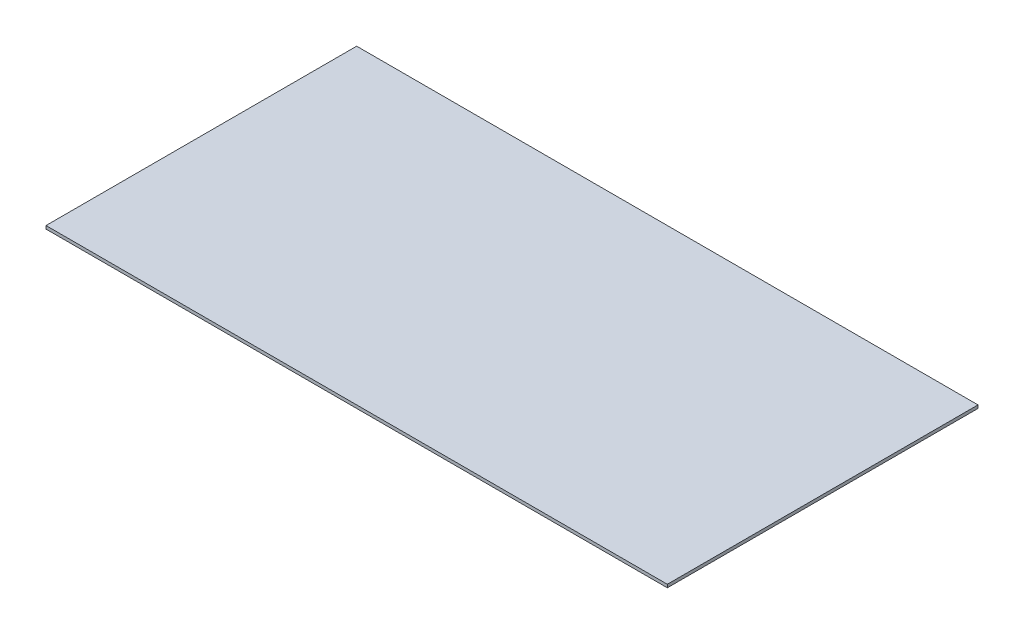
ISO-10303-21;
HEADER;
FILE_DESCRIPTION(('STEP AP214'),'2;1');
FILE_NAME('part.step','',(''),(''),'','','');
FILE_SCHEMA(('AUTOMOTIVE_DESIGN { 1 0 10303 214 1 1 1 1 }'));
ENDSEC;
DATA;
#1=APPLICATION_CONTEXT('core data for automotive mechanical design processes');
#2=APPLICATION_PROTOCOL_DEFINITION('international standard','automotive_design',2000,#1);
#3=PRODUCT_CONTEXT('',#1,'mechanical');
#4=PRODUCT('Part','Part','',(#3));
#5=PRODUCT_RELATED_PRODUCT_CATEGORY('part','',(#4));
#6=PRODUCT_DEFINITION_FORMATION('','',#4);
#7=PRODUCT_DEFINITION_CONTEXT('part definition',#1,'design');
#8=PRODUCT_DEFINITION('design','',#6,#7);
#9=PRODUCT_DEFINITION_SHAPE('','',#8);
#10=(LENGTH_UNIT() NAMED_UNIT(*) SI_UNIT(.MILLI.,.METRE.));
#11=(NAMED_UNIT(*) PLANE_ANGLE_UNIT() SI_UNIT($,.RADIAN.));
#12=(NAMED_UNIT(*) SI_UNIT($,.STERADIAN.) SOLID_ANGLE_UNIT());
#13=UNCERTAINTY_MEASURE_WITH_UNIT(LENGTH_MEASURE(1.E-05),#10,'distance_accuracy_value','');
#14=(GEOMETRIC_REPRESENTATION_CONTEXT(3) GLOBAL_UNCERTAINTY_ASSIGNED_CONTEXT((#13)) GLOBAL_UNIT_ASSIGNED_CONTEXT((#10,
#11,#12)) REPRESENTATION_CONTEXT('',''));
#15=CARTESIAN_POINT('',(0.,0.,0.));
#16=DIRECTION('',(0.,0.,1.));
#17=DIRECTION('',(1.,0.,0.));
#18=AXIS2_PLACEMENT_3D('',#15,#16,#17);
#19=CARTESIAN_POINT('',(1000.,10.,-500.));
#20=DIRECTION('',(-1.,0.,0.));
#21=DIRECTION('',(0.,0.,1.));
#22=AXIS2_PLACEMENT_3D('',#19,#20,#21);
#23=PLANE('',#22);
#24=DIRECTION('',(0.,0.,-1.));
#25=VECTOR('',#24,1.);
#26=CARTESIAN_POINT('',(1000.,0.,-500.));
#27=LINE('',#26,#25);
#28=CARTESIAN_POINT('',(1000.,0.,500.));
#29=VERTEX_POINT('',#28);
#30=CARTESIAN_POINT('',(1000.,0.,-500.));
#31=VERTEX_POINT('',#30);
#32=EDGE_CURVE('E95',#29,#31,#27,.T.);
#33=ORIENTED_EDGE('',*,*,#32,.T.);
#34=DIRECTION('',(0.,-1.,0.));
#35=VECTOR('',#34,1.);
#36=CARTESIAN_POINT('',(1000.,10.,-500.));
#37=LINE('',#36,#35);
#38=CARTESIAN_POINT('',(1000.,10.,-500.));
#39=VERTEX_POINT('',#38);
#40=EDGE_CURVE('E11',#39,#31,#37,.T.);
#41=ORIENTED_EDGE('',*,*,#40,.F.);
#42=DIRECTION('',(0.,0.,-1.));
#43=VECTOR('',#42,1.);
#44=CARTESIAN_POINT('',(1000.,10.,-500.));
#45=LINE('',#44,#43);
#46=CARTESIAN_POINT('',(1000.,10.,500.));
#47=VERTEX_POINT('',#46);
#48=EDGE_CURVE('E83',#47,#39,#45,.T.);
#49=ORIENTED_EDGE('',*,*,#48,.F.);
#50=DIRECTION('',(0.,-1.,0.));
#51=VECTOR('',#50,1.);
#52=CARTESIAN_POINT('',(1000.,10.,500.));
#53=LINE('',#52,#51);
#54=EDGE_CURVE('E91',#47,#29,#53,.T.);
#55=ORIENTED_EDGE('',*,*,#54,.T.);
#56=EDGE_LOOP('',(#33,#41,#49,#55));
#57=FACE_BOUND('',#56,.T.);
#58=ADVANCED_FACE('F32',(#57),#23,.F.);
#59=CARTESIAN_POINT('',(-999.999999999999,10.,-500.));
#60=DIRECTION('',(0.,0.,1.));
#61=DIRECTION('',(1.,0.,0.));
#62=AXIS2_PLACEMENT_3D('',#59,#60,#61);
#63=PLANE('',#62);
#64=DIRECTION('',(-1.,0.,0.));
#65=VECTOR('',#64,1.);
#66=CARTESIAN_POINT('',(-999.999999999999,0.,-500.));
#67=LINE('',#66,#65);
#68=CARTESIAN_POINT('',(-999.999999999999,0.,-500.));
#69=VERTEX_POINT('',#68);
#70=EDGE_CURVE('E87',#31,#69,#67,.T.);
#71=ORIENTED_EDGE('',*,*,#70,.T.);
#72=DIRECTION('',(0.,-1.,0.));
#73=VECTOR('',#72,1.);
#74=CARTESIAN_POINT('',(-999.999999999999,10.,-500.));
#75=LINE('',#74,#73);
#76=CARTESIAN_POINT('',(-999.999999999999,10.,-500.));
#77=VERTEX_POINT('',#76);
#78=EDGE_CURVE('E40',#77,#69,#75,.T.);
#79=ORIENTED_EDGE('',*,*,#78,.F.);
#80=DIRECTION('',(-1.,0.,0.));
#81=VECTOR('',#80,1.);
#82=CARTESIAN_POINT('',(-999.999999999999,10.,-500.));
#83=LINE('',#82,#81);
#84=EDGE_CURVE('E78',#39,#77,#83,.T.);
#85=ORIENTED_EDGE('',*,*,#84,.F.);
#86=ORIENTED_EDGE('',*,*,#40,.T.);
#87=EDGE_LOOP('',(#71,#79,#85,#86));
#88=FACE_BOUND('',#87,.T.);
#89=ADVANCED_FACE('F86',(#88),#63,.F.);
#90=CARTESIAN_POINT('',(-999.999999999999,10.,-500.));
#91=DIRECTION('',(1.,0.,0.));
#92=DIRECTION('',(0.,0.,-1.));
#93=AXIS2_PLACEMENT_3D('',#90,#91,#92);
#94=PLANE('',#93);
#95=DIRECTION('',(0.,0.,1.));
#96=VECTOR('',#95,1.);
#97=CARTESIAN_POINT('',(-999.999999999999,0.,-500.));
#98=LINE('',#97,#96);
#99=CARTESIAN_POINT('',(-999.999999999999,0.,500.));
#100=VERTEX_POINT('',#99);
#101=EDGE_CURVE('E65',#69,#100,#98,.T.);
#102=ORIENTED_EDGE('',*,*,#101,.T.);
#103=DIRECTION('',(0.,-1.,0.));
#104=VECTOR('',#103,1.);
#105=CARTESIAN_POINT('',(-999.999999999999,10.,500.));
#106=LINE('',#105,#104);
#107=CARTESIAN_POINT('',(-999.999999999999,10.,500.));
#108=VERTEX_POINT('',#107);
#109=EDGE_CURVE('E88',#108,#100,#106,.T.);
#110=ORIENTED_EDGE('',*,*,#109,.F.);
#111=DIRECTION('',(0.,0.,1.));
#112=VECTOR('',#111,1.);
#113=CARTESIAN_POINT('',(-999.999999999999,10.,-500.));
#114=LINE('',#113,#112);
#115=EDGE_CURVE('E81',#77,#108,#114,.T.);
#116=ORIENTED_EDGE('',*,*,#115,.F.);
#117=ORIENTED_EDGE('',*,*,#78,.T.);
#118=EDGE_LOOP('',(#102,#110,#116,#117));
#119=FACE_BOUND('',#118,.T.);
#120=ADVANCED_FACE('F89',(#119),#94,.F.);
#121=CARTESIAN_POINT('',(-999.999999999999,10.,500.));
#122=DIRECTION('',(0.,0.,-1.));
#123=DIRECTION('',(-1.,0.,0.));
#124=AXIS2_PLACEMENT_3D('',#121,#122,#123);
#125=PLANE('',#124);
#126=DIRECTION('',(1.,0.,0.));
#127=VECTOR('',#126,1.);
#128=CARTESIAN_POINT('',(-999.999999999999,0.,500.));
#129=LINE('',#128,#127);
#130=EDGE_CURVE('E71',#100,#29,#129,.T.);
#131=ORIENTED_EDGE('',*,*,#130,.T.);
#132=ORIENTED_EDGE('',*,*,#54,.F.);
#133=DIRECTION('',(1.,0.,0.));
#134=VECTOR('',#133,1.);
#135=CARTESIAN_POINT('',(-999.999999999999,10.,500.));
#136=LINE('',#135,#134);
#137=EDGE_CURVE('E48',#108,#47,#136,.T.);
#138=ORIENTED_EDGE('',*,*,#137,.F.);
#139=ORIENTED_EDGE('',*,*,#109,.T.);
#140=EDGE_LOOP('',(#131,#132,#138,#139));
#141=FACE_BOUND('',#140,.T.);
#142=ADVANCED_FACE('F102',(#141),#125,.F.);
#143=CARTESIAN_POINT('',(0.,10.,0.));
#144=DIRECTION('',(0.,1.,0.));
#145=DIRECTION('',(0.,0.,1.));
#146=AXIS2_PLACEMENT_3D('',#143,#144,#145);
#147=PLANE('',#146);
#148=ORIENTED_EDGE('',*,*,#48,.T.);
#149=ORIENTED_EDGE('',*,*,#84,.T.);
#150=ORIENTED_EDGE('',*,*,#115,.T.);
#151=ORIENTED_EDGE('',*,*,#137,.T.);
#152=EDGE_LOOP('',(#148,#149,#150,#151));
#153=FACE_BOUND('',#152,.T.);
#154=ADVANCED_FACE('F79',(#153),#147,.T.);
#155=CARTESIAN_POINT('',(0.,0.,0.));
#156=DIRECTION('',(0.,1.,0.));
#157=DIRECTION('',(0.,0.,1.));
#158=AXIS2_PLACEMENT_3D('',#155,#156,#157);
#159=PLANE('',#158);
#160=ORIENTED_EDGE('',*,*,#32,.F.);
#161=ORIENTED_EDGE('',*,*,#130,.F.);
#162=ORIENTED_EDGE('',*,*,#101,.F.);
#163=ORIENTED_EDGE('',*,*,#70,.F.);
#164=EDGE_LOOP('',(#160,#161,#162,#163));
#165=FACE_BOUND('',#164,.T.);
#166=ADVANCED_FACE('F105',(#165),#159,.F.);
#167=CLOSED_SHELL('',(#58,#89,#120,#142,#154,#166));
#168=MANIFOLD_SOLID_BREP('B2',#167);
#169=ADVANCED_BREP_SHAPE_REPRESENTATION('',(#18,#168),#14);
#170=SHAPE_DEFINITION_REPRESENTATION(#9,#169);
ENDSEC;
END-ISO-10303-21;
